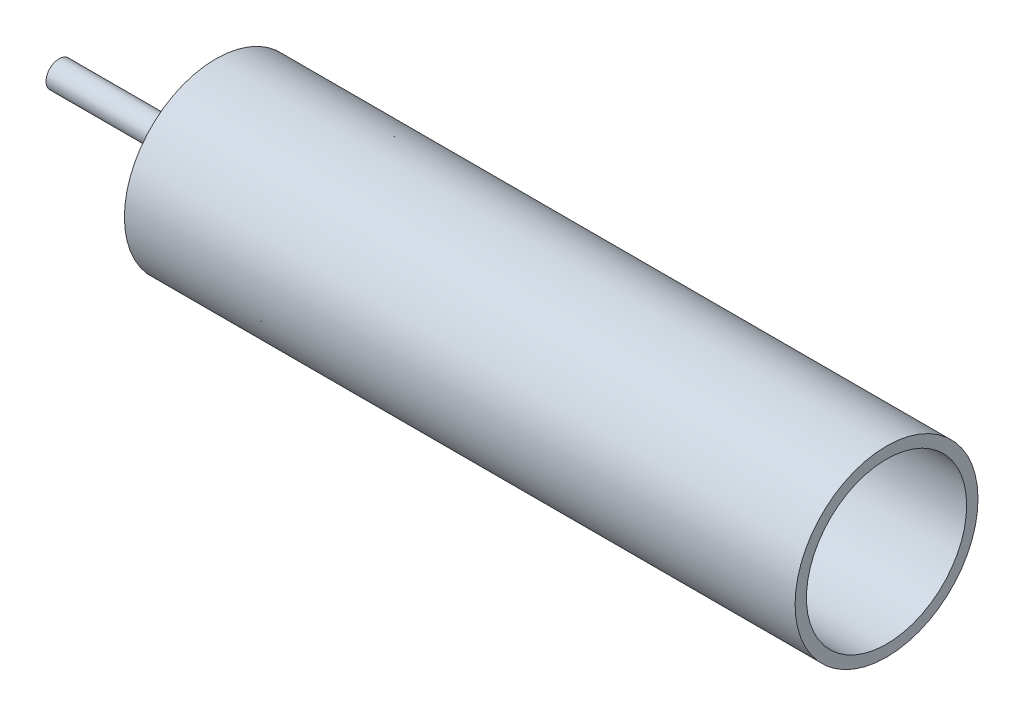
ISO-10303-21;
HEADER;
FILE_DESCRIPTION(('STEP AP214'),'2;1');
FILE_NAME('part.step','',(''),(''),'','','');
FILE_SCHEMA(('AUTOMOTIVE_DESIGN { 1 0 10303 214 1 1 1 1 }'));
ENDSEC;
DATA;
#1=APPLICATION_CONTEXT('core data for automotive mechanical design processes');
#2=APPLICATION_PROTOCOL_DEFINITION('international standard','automotive_design',2000,#1);
#3=PRODUCT_CONTEXT('',#1,'mechanical');
#4=PRODUCT('Part','Part','',(#3));
#5=PRODUCT_RELATED_PRODUCT_CATEGORY('part','',(#4));
#6=PRODUCT_DEFINITION_FORMATION('','',#4);
#7=PRODUCT_DEFINITION_CONTEXT('part definition',#1,'design');
#8=PRODUCT_DEFINITION('design','',#6,#7);
#9=PRODUCT_DEFINITION_SHAPE('','',#8);
#10=(LENGTH_UNIT() NAMED_UNIT(*) SI_UNIT(.MILLI.,.METRE.));
#11=(NAMED_UNIT(*) PLANE_ANGLE_UNIT() SI_UNIT($,.RADIAN.));
#12=(NAMED_UNIT(*) SI_UNIT($,.STERADIAN.) SOLID_ANGLE_UNIT());
#13=UNCERTAINTY_MEASURE_WITH_UNIT(LENGTH_MEASURE(1.E-05),#10,'distance_accuracy_value','');
#14=(GEOMETRIC_REPRESENTATION_CONTEXT(3) GLOBAL_UNCERTAINTY_ASSIGNED_CONTEXT((#13)) GLOBAL_UNIT_ASSIGNED_CONTEXT((#10,
#11,#12)) REPRESENTATION_CONTEXT('',''));
#15=CARTESIAN_POINT('',(0.,0.,0.));
#16=DIRECTION('',(0.,0.,1.));
#17=DIRECTION('',(1.,0.,0.));
#18=AXIS2_PLACEMENT_3D('',#15,#16,#17);
#19=CARTESIAN_POINT('',(-200.,0.,-47.5));
#20=DIRECTION('',(1.,0.,0.));
#21=DIRECTION('',(0.,0.,-1.));
#22=AXIS2_PLACEMENT_3D('',#19,#20,#21);
#23=CYLINDRICAL_SURFACE('',#22,26.67);
#24=CARTESIAN_POINT('',(41.3000000000001,0.,-47.5));
#25=DIRECTION('',(1.,0.,0.));
#26=DIRECTION('',(0.,0.,-1.));
#27=AXIS2_PLACEMENT_3D('',#24,#25,#26);
#28=CIRCLE('',#27,26.67);
#29=CARTESIAN_POINT('',(41.3000000000001,0.,-74.17));
#30=VERTEX_POINT('',#29);
#31=EDGE_CURVE('E11',#30,#30,#28,.T.);
#32=ORIENTED_EDGE('',*,*,#31,.F.);
#33=EDGE_LOOP('',(#32));
#34=FACE_BOUND('',#33,.T.);
#35=CARTESIAN_POINT('',(-154.28,0.,-47.5));
#36=DIRECTION('',(-1.,0.,0.));
#37=DIRECTION('',(0.,0.,1.));
#38=AXIS2_PLACEMENT_3D('',#35,#36,#37);
#39=CIRCLE('',#38,26.67);
#40=CARTESIAN_POINT('',(-154.28,0.,-20.83));
#41=VERTEX_POINT('',#40);
#42=EDGE_CURVE('E45',#41,#41,#39,.T.);
#43=ORIENTED_EDGE('',*,*,#42,.F.);
#44=EDGE_LOOP('',(#43));
#45=FACE_BOUND('',#44,.T.);
#46=ADVANCED_FACE('F38',(#34,#45),#23,.T.);
#47=CARTESIAN_POINT('',(41.3000000000001,0.,-47.5));
#48=DIRECTION('',(1.,0.,0.));
#49=DIRECTION('',(0.,0.,-1.));
#50=AXIS2_PLACEMENT_3D('',#47,#48,#49);
#51=PLANE('',#50);
#52=CARTESIAN_POINT('',(41.3000000000001,0.,-47.5));
#53=DIRECTION('',(1.,0.,0.));
#54=DIRECTION('',(0.,0.,-1.));
#55=AXIS2_PLACEMENT_3D('',#52,#53,#54);
#56=CIRCLE('',#55,23.368);
#57=CARTESIAN_POINT('',(41.3000000000001,0.,-70.868));
#58=VERTEX_POINT('',#57);
#59=EDGE_CURVE('E57',#58,#58,#56,.T.);
#60=ORIENTED_EDGE('',*,*,#59,.F.);
#61=EDGE_LOOP('',(#60));
#62=FACE_BOUND('',#61,.T.);
#63=ORIENTED_EDGE('',*,*,#31,.T.);
#64=EDGE_LOOP('',(#63));
#65=FACE_BOUND('',#64,.T.);
#66=ADVANCED_FACE('F87',(#62,#65),#51,.T.);
#67=CARTESIAN_POINT('',(-154.28,0.,-47.5));
#68=DIRECTION('',(-1.,0.,0.));
#69=DIRECTION('',(0.,0.,1.));
#70=AXIS2_PLACEMENT_3D('',#67,#68,#69);
#71=PLANE('',#70);
#72=CARTESIAN_POINT('',(-154.28,0.,-47.5));
#73=DIRECTION('',(-1.,0.,0.));
#74=DIRECTION('',(0.,0.,1.));
#75=AXIS2_PLACEMENT_3D('',#72,#73,#74);
#76=CIRCLE('',#75,3.81);
#77=CARTESIAN_POINT('',(-154.28,0.,-43.69));
#78=VERTEX_POINT('',#77);
#79=EDGE_CURVE('E49',#78,#78,#76,.T.);
#80=ORIENTED_EDGE('',*,*,#79,.F.);
#81=EDGE_LOOP('',(#80));
#82=FACE_BOUND('',#81,.T.);
#83=ORIENTED_EDGE('',*,*,#42,.T.);
#84=EDGE_LOOP('',(#83));
#85=FACE_BOUND('',#84,.T.);
#86=ADVANCED_FACE('F93',(#82,#85),#71,.T.);
#87=CARTESIAN_POINT('',(-154.28,0.,-47.5));
#88=DIRECTION('',(-1.,0.,0.));
#89=DIRECTION('',(0.,0.,1.));
#90=AXIS2_PLACEMENT_3D('',#87,#88,#89);
#91=CYLINDRICAL_SURFACE('',#90,3.81);
#92=ORIENTED_EDGE('',*,*,#79,.T.);
#93=EDGE_LOOP('',(#92));
#94=FACE_BOUND('',#93,.T.);
#95=CARTESIAN_POINT('',(-200.,0.,-47.5));
#96=DIRECTION('',(-1.,0.,0.));
#97=DIRECTION('',(0.,0.,1.));
#98=AXIS2_PLACEMENT_3D('',#95,#96,#97);
#99=CIRCLE('',#98,3.81);
#100=CARTESIAN_POINT('',(-200.,0.,-43.69));
#101=VERTEX_POINT('',#100);
#102=EDGE_CURVE('E53',#101,#101,#99,.T.);
#103=ORIENTED_EDGE('',*,*,#102,.F.);
#104=EDGE_LOOP('',(#103));
#105=FACE_BOUND('',#104,.T.);
#106=ADVANCED_FACE('F98',(#94,#105),#91,.T.);
#107=CARTESIAN_POINT('',(-200.,0.,-47.5));
#108=DIRECTION('',(1.,0.,0.));
#109=DIRECTION('',(0.,0.,-1.));
#110=AXIS2_PLACEMENT_3D('',#107,#108,#109);
#111=PLANE('',#110);
#112=CARTESIAN_POINT('',(-200.,0.,-47.5));
#113=DIRECTION('',(1.,0.,0.));
#114=DIRECTION('',(0.,0.,-1.));
#115=AXIS2_PLACEMENT_3D('',#112,#113,#114);
#116=CIRCLE('',#115,1.27);
#117=CARTESIAN_POINT('',(-200.,0.,-48.77));
#118=VERTEX_POINT('',#117);
#119=EDGE_CURVE('E65',#118,#118,#116,.T.);
#120=ORIENTED_EDGE('',*,*,#119,.T.);
#121=EDGE_LOOP('',(#120));
#122=FACE_BOUND('',#121,.T.);
#123=ORIENTED_EDGE('',*,*,#102,.T.);
#124=EDGE_LOOP('',(#123));
#125=FACE_BOUND('',#124,.T.);
#126=ADVANCED_FACE('F40',(#122,#125),#111,.F.);
#127=CARTESIAN_POINT('',(-200.,0.,-47.5));
#128=DIRECTION('',(1.,0.,0.));
#129=DIRECTION('',(0.,0.,-1.));
#130=AXIS2_PLACEMENT_3D('',#127,#128,#129);
#131=CYLINDRICAL_SURFACE('',#130,23.368);
#132=ORIENTED_EDGE('',*,*,#59,.T.);
#133=EDGE_LOOP('',(#132));
#134=FACE_BOUND('',#133,.T.);
#135=CARTESIAN_POINT('',(-150.978,0.,-47.5));
#136=DIRECTION('',(-1.,0.,0.));
#137=DIRECTION('',(0.,0.,1.));
#138=AXIS2_PLACEMENT_3D('',#135,#136,#137);
#139=CIRCLE('',#138,23.368);
#140=CARTESIAN_POINT('',(-150.978,0.,-24.132));
#141=VERTEX_POINT('',#140);
#142=EDGE_CURVE('E61',#141,#141,#139,.T.);
#143=ORIENTED_EDGE('',*,*,#142,.T.);
#144=EDGE_LOOP('',(#143));
#145=FACE_BOUND('',#144,.T.);
#146=ADVANCED_FACE('F81',(#134,#145),#131,.F.);
#147=CARTESIAN_POINT('',(-150.978,0.,-47.5));
#148=DIRECTION('',(-1.,0.,0.));
#149=DIRECTION('',(0.,0.,1.));
#150=AXIS2_PLACEMENT_3D('',#147,#148,#149);
#151=PLANE('',#150);
#152=CARTESIAN_POINT('',(-150.978,0.,-47.5));
#153=DIRECTION('',(-1.,0.,0.));
#154=DIRECTION('',(0.,0.,1.));
#155=AXIS2_PLACEMENT_3D('',#152,#153,#154);
#156=CIRCLE('',#155,1.27);
#157=CARTESIAN_POINT('',(-150.978,0.,-46.23));
#158=VERTEX_POINT('',#157);
#159=EDGE_CURVE('E62',#158,#158,#156,.T.);
#160=ORIENTED_EDGE('',*,*,#159,.T.);
#161=EDGE_LOOP('',(#160));
#162=FACE_BOUND('',#161,.T.);
#163=ORIENTED_EDGE('',*,*,#142,.F.);
#164=EDGE_LOOP('',(#163));
#165=FACE_BOUND('',#164,.T.);
#166=ADVANCED_FACE('F75',(#162,#165),#151,.F.);
#167=CARTESIAN_POINT('',(-154.28,0.,-47.5));
#168=DIRECTION('',(-1.,0.,0.));
#169=DIRECTION('',(0.,0.,1.));
#170=AXIS2_PLACEMENT_3D('',#167,#168,#169);
#171=CYLINDRICAL_SURFACE('',#170,1.27);
#172=ORIENTED_EDGE('',*,*,#159,.F.);
#173=EDGE_LOOP('',(#172));
#174=FACE_BOUND('',#173,.T.);
#175=ORIENTED_EDGE('',*,*,#119,.F.);
#176=EDGE_LOOP('',(#175));
#177=FACE_BOUND('',#176,.T.);
#178=ADVANCED_FACE('F73',(#174,#177),#171,.F.);
#179=CLOSED_SHELL('',(#46,#66,#86,#106,#126,#146,#166,#178));
#180=MANIFOLD_SOLID_BREP('B2',#179);
#181=ADVANCED_BREP_SHAPE_REPRESENTATION('',(#18,#180),#14);
#182=SHAPE_DEFINITION_REPRESENTATION(#9,#181);
ENDSEC;
END-ISO-10303-21;
